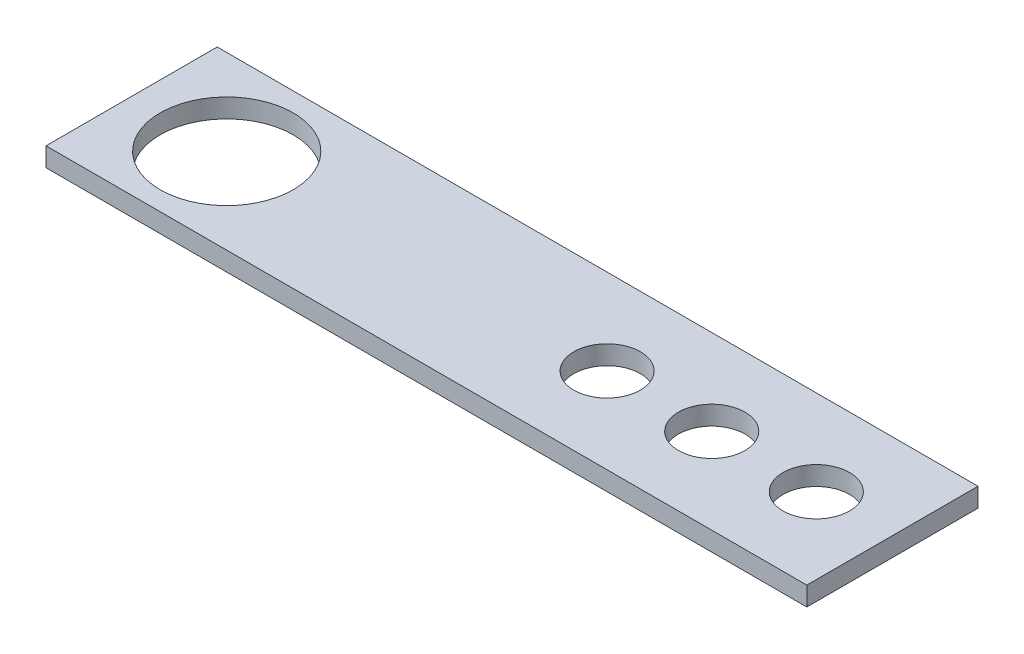
ISO-10303-21;
HEADER;
FILE_DESCRIPTION(('STEP AP214'),'2;1');
FILE_NAME('part.step','',(''),(''),'','','');
FILE_SCHEMA(('AUTOMOTIVE_DESIGN { 1 0 10303 214 1 1 1 1 }'));
ENDSEC;
DATA;
#1=APPLICATION_CONTEXT('core data for automotive mechanical design processes');
#2=APPLICATION_PROTOCOL_DEFINITION('international standard','automotive_design',2000,#1);
#3=PRODUCT_CONTEXT('',#1,'mechanical');
#4=PRODUCT('Part','Part','',(#3));
#5=PRODUCT_RELATED_PRODUCT_CATEGORY('part','',(#4));
#6=PRODUCT_DEFINITION_FORMATION('','',#4);
#7=PRODUCT_DEFINITION_CONTEXT('part definition',#1,'design');
#8=PRODUCT_DEFINITION('design','',#6,#7);
#9=PRODUCT_DEFINITION_SHAPE('','',#8);
#10=(LENGTH_UNIT() NAMED_UNIT(*) SI_UNIT(.MILLI.,.METRE.));
#11=(NAMED_UNIT(*) PLANE_ANGLE_UNIT() SI_UNIT($,.RADIAN.));
#12=(NAMED_UNIT(*) SI_UNIT($,.STERADIAN.) SOLID_ANGLE_UNIT());
#13=UNCERTAINTY_MEASURE_WITH_UNIT(LENGTH_MEASURE(1.E-05),#10,'distance_accuracy_value','');
#14=(GEOMETRIC_REPRESENTATION_CONTEXT(3) GLOBAL_UNCERTAINTY_ASSIGNED_CONTEXT((#13)) GLOBAL_UNIT_ASSIGNED_CONTEXT((#10,
#11,#12)) REPRESENTATION_CONTEXT('',''));
#15=CARTESIAN_POINT('',(0.,0.,0.));
#16=DIRECTION('',(0.,0.,1.));
#17=DIRECTION('',(1.,0.,0.));
#18=AXIS2_PLACEMENT_3D('',#15,#16,#17);
#19=CARTESIAN_POINT('',(16.,-2.,0.));
#20=DIRECTION('',(0.,1.,0.));
#21=DIRECTION('',(0.,0.,1.));
#22=AXIS2_PLACEMENT_3D('',#19,#20,#21);
#23=CYLINDRICAL_SURFACE('',#22,1.75);
#24=CARTESIAN_POINT('',(16.,0.,0.));
#25=DIRECTION('',(0.,-1.,0.));
#26=DIRECTION('',(0.,0.,-1.));
#27=AXIS2_PLACEMENT_3D('',#24,#25,#26);
#28=CIRCLE('',#27,1.75);
#29=CARTESIAN_POINT('',(16.,0.,-1.75));
#30=VERTEX_POINT('',#29);
#31=EDGE_CURVE('E40',#30,#30,#28,.T.);
#32=ORIENTED_EDGE('',*,*,#31,.T.);
#33=EDGE_LOOP('',(#32));
#34=FACE_BOUND('',#33,.T.);
#35=CARTESIAN_POINT('',(16.,1.,0.));
#36=DIRECTION('',(0.,1.,0.));
#37=DIRECTION('',(0.,0.,1.));
#38=AXIS2_PLACEMENT_3D('',#35,#36,#37);
#39=CIRCLE('',#38,1.75);
#40=CARTESIAN_POINT('',(16.,1.,1.75));
#41=VERTEX_POINT('',#40);
#42=EDGE_CURVE('E11',#41,#41,#39,.T.);
#43=ORIENTED_EDGE('',*,*,#42,.T.);
#44=EDGE_LOOP('',(#43));
#45=FACE_BOUND('',#44,.T.);
#46=ADVANCED_FACE('F32',(#34,#45),#23,.F.);
#47=CARTESIAN_POINT('',(20.,1.,4.5));
#48=DIRECTION('',(-1.,0.,0.));
#49=DIRECTION('',(0.,0.,1.));
#50=AXIS2_PLACEMENT_3D('',#47,#48,#49);
#51=PLANE('',#50);
#52=DIRECTION('',(0.,0.,-1.));
#53=VECTOR('',#52,1.);
#54=CARTESIAN_POINT('',(20.,0.,4.5));
#55=LINE('',#54,#53);
#56=CARTESIAN_POINT('',(20.,0.,4.5));
#57=VERTEX_POINT('',#56);
#58=CARTESIAN_POINT('',(20.,0.,-4.5));
#59=VERTEX_POINT('',#58);
#60=EDGE_CURVE('E100',#57,#59,#55,.T.);
#61=ORIENTED_EDGE('',*,*,#60,.T.);
#62=DIRECTION('',(0.,-1.,0.));
#63=VECTOR('',#62,1.);
#64=CARTESIAN_POINT('',(20.,1.,-4.5));
#65=LINE('',#64,#63);
#66=CARTESIAN_POINT('',(20.,1.,-4.5));
#67=VERTEX_POINT('',#66);
#68=EDGE_CURVE('E91',#67,#59,#65,.T.);
#69=ORIENTED_EDGE('',*,*,#68,.F.);
#70=DIRECTION('',(0.,0.,-1.));
#71=VECTOR('',#70,1.);
#72=CARTESIAN_POINT('',(20.,1.,4.5));
#73=LINE('',#72,#71);
#74=CARTESIAN_POINT('',(20.,1.,4.5));
#75=VERTEX_POINT('',#74);
#76=EDGE_CURVE('E85',#75,#67,#73,.T.);
#77=ORIENTED_EDGE('',*,*,#76,.F.);
#78=DIRECTION('',(0.,-1.,0.));
#79=VECTOR('',#78,1.);
#80=CARTESIAN_POINT('',(20.,1.,4.5));
#81=LINE('',#80,#79);
#82=EDGE_CURVE('E96',#75,#57,#81,.T.);
#83=ORIENTED_EDGE('',*,*,#82,.T.);
#84=EDGE_LOOP('',(#61,#69,#77,#83));
#85=FACE_BOUND('',#84,.T.);
#86=ADVANCED_FACE('F140',(#85),#51,.F.);
#87=CARTESIAN_POINT('',(-20.,1.,-4.5));
#88=DIRECTION('',(0.,0.,1.));
#89=DIRECTION('',(1.,0.,0.));
#90=AXIS2_PLACEMENT_3D('',#87,#88,#89);
#91=PLANE('',#90);
#92=DIRECTION('',(-1.,0.,0.));
#93=VECTOR('',#92,1.);
#94=CARTESIAN_POINT('',(-20.,0.,-4.5));
#95=LINE('',#94,#93);
#96=CARTESIAN_POINT('',(-20.,0.,-4.5));
#97=VERTEX_POINT('',#96);
#98=EDGE_CURVE('E90',#59,#97,#95,.T.);
#99=ORIENTED_EDGE('',*,*,#98,.T.);
#100=DIRECTION('',(0.,-1.,0.));
#101=VECTOR('',#100,1.);
#102=CARTESIAN_POINT('',(-20.,1.,-4.5));
#103=LINE('',#102,#101);
#104=CARTESIAN_POINT('',(-20.,1.,-4.5));
#105=VERTEX_POINT('',#104);
#106=EDGE_CURVE('E88',#105,#97,#103,.T.);
#107=ORIENTED_EDGE('',*,*,#106,.F.);
#108=DIRECTION('',(-1.,0.,0.));
#109=VECTOR('',#108,1.);
#110=CARTESIAN_POINT('',(-20.,1.,-4.5));
#111=LINE('',#110,#109);
#112=EDGE_CURVE('E79',#67,#105,#111,.T.);
#113=ORIENTED_EDGE('',*,*,#112,.F.);
#114=ORIENTED_EDGE('',*,*,#68,.T.);
#115=EDGE_LOOP('',(#99,#107,#113,#114));
#116=FACE_BOUND('',#115,.T.);
#117=ADVANCED_FACE('F89',(#116),#91,.F.);
#118=CARTESIAN_POINT('',(-20.,1.,4.5));
#119=DIRECTION('',(1.,0.,0.));
#120=DIRECTION('',(0.,0.,-1.));
#121=AXIS2_PLACEMENT_3D('',#118,#119,#120);
#122=PLANE('',#121);
#123=DIRECTION('',(0.,0.,1.));
#124=VECTOR('',#123,1.);
#125=CARTESIAN_POINT('',(-20.,0.,4.5));
#126=LINE('',#125,#124);
#127=CARTESIAN_POINT('',(-20.,0.,4.5));
#128=VERTEX_POINT('',#127);
#129=EDGE_CURVE('E65',#97,#128,#126,.T.);
#130=ORIENTED_EDGE('',*,*,#129,.T.);
#131=DIRECTION('',(0.,-1.,0.));
#132=VECTOR('',#131,1.);
#133=CARTESIAN_POINT('',(-20.,1.,4.5));
#134=LINE('',#133,#132);
#135=CARTESIAN_POINT('',(-20.,1.,4.5));
#136=VERTEX_POINT('',#135);
#137=EDGE_CURVE('E92',#136,#128,#134,.T.);
#138=ORIENTED_EDGE('',*,*,#137,.F.);
#139=DIRECTION('',(0.,0.,1.));
#140=VECTOR('',#139,1.);
#141=CARTESIAN_POINT('',(-20.,1.,4.5));
#142=LINE('',#141,#140);
#143=EDGE_CURVE('E83',#105,#136,#142,.T.);
#144=ORIENTED_EDGE('',*,*,#143,.F.);
#145=ORIENTED_EDGE('',*,*,#106,.T.);
#146=EDGE_LOOP('',(#130,#138,#144,#145));
#147=FACE_BOUND('',#146,.T.);
#148=ADVANCED_FACE('F94',(#147),#122,.F.);
#149=CARTESIAN_POINT('',(-20.,1.,4.5));
#150=DIRECTION('',(0.,0.,-1.));
#151=DIRECTION('',(-1.,0.,0.));
#152=AXIS2_PLACEMENT_3D('',#149,#150,#151);
#153=PLANE('',#152);
#154=DIRECTION('',(1.,0.,0.));
#155=VECTOR('',#154,1.);
#156=CARTESIAN_POINT('',(-20.,0.,4.5));
#157=LINE('',#156,#155);
#158=EDGE_CURVE('E71',#128,#57,#157,.T.);
#159=ORIENTED_EDGE('',*,*,#158,.T.);
#160=ORIENTED_EDGE('',*,*,#82,.F.);
#161=DIRECTION('',(1.,0.,0.));
#162=VECTOR('',#161,1.);
#163=CARTESIAN_POINT('',(-20.,1.,4.5));
#164=LINE('',#163,#162);
#165=EDGE_CURVE('E48',#136,#75,#164,.T.);
#166=ORIENTED_EDGE('',*,*,#165,.F.);
#167=ORIENTED_EDGE('',*,*,#137,.T.);
#168=EDGE_LOOP('',(#159,#160,#166,#167));
#169=FACE_BOUND('',#168,.T.);
#170=ADVANCED_FACE('F133',(#169),#153,.F.);
#171=CARTESIAN_POINT('',(0.,1.,0.));
#172=DIRECTION('',(0.,-1.,0.));
#173=DIRECTION('',(0.,0.,-1.));
#174=AXIS2_PLACEMENT_3D('',#171,#172,#173);
#175=PLANE('',#174);
#176=CARTESIAN_POINT('',(10.5,1.,0.));
#177=DIRECTION('',(0.,1.,0.));
#178=DIRECTION('',(0.,0.,1.));
#179=AXIS2_PLACEMENT_3D('',#176,#177,#178);
#180=CIRCLE('',#179,1.75);
#181=CARTESIAN_POINT('',(10.5,1.,1.75));
#182=VERTEX_POINT('',#181);
#183=EDGE_CURVE('E202',#182,#182,#180,.T.);
#184=ORIENTED_EDGE('',*,*,#183,.F.);
#185=EDGE_LOOP('',(#184));
#186=FACE_BOUND('',#185,.T.);
#187=CARTESIAN_POINT('',(5.,1.,0.));
#188=DIRECTION('',(0.,1.,0.));
#189=DIRECTION('',(0.,0.,1.));
#190=AXIS2_PLACEMENT_3D('',#187,#188,#189);
#191=CIRCLE('',#190,1.75);
#192=CARTESIAN_POINT('',(5.,1.,1.75));
#193=VERTEX_POINT('',#192);
#194=EDGE_CURVE('E115',#193,#193,#191,.T.);
#195=ORIENTED_EDGE('',*,*,#194,.F.);
#196=EDGE_LOOP('',(#195));
#197=FACE_BOUND('',#196,.T.);
#198=CARTESIAN_POINT('',(-15.,1.,0.));
#199=DIRECTION('',(0.,1.,0.));
#200=DIRECTION('',(0.,0.,1.));
#201=AXIS2_PLACEMENT_3D('',#198,#199,#200);
#202=CIRCLE('',#201,3.5);
#203=CARTESIAN_POINT('',(-15.,1.,3.5));
#204=VERTEX_POINT('',#203);
#205=EDGE_CURVE('E112',#204,#204,#202,.T.);
#206=ORIENTED_EDGE('',*,*,#205,.F.);
#207=EDGE_LOOP('',(#206));
#208=FACE_BOUND('',#207,.T.);
#209=ORIENTED_EDGE('',*,*,#76,.T.);
#210=ORIENTED_EDGE('',*,*,#112,.T.);
#211=ORIENTED_EDGE('',*,*,#143,.T.);
#212=ORIENTED_EDGE('',*,*,#165,.T.);
#213=EDGE_LOOP('',(#209,#210,#211,#212));
#214=FACE_BOUND('',#213,.T.);
#215=ORIENTED_EDGE('',*,*,#42,.F.);
#216=EDGE_LOOP('',(#215));
#217=FACE_BOUND('',#216,.T.);
#218=ADVANCED_FACE('F80',(#186,#197,#208,#214,#217),#175,.F.);
#219=CARTESIAN_POINT('',(0.,0.,0.));
#220=DIRECTION('',(0.,-1.,0.));
#221=DIRECTION('',(0.,0.,-1.));
#222=AXIS2_PLACEMENT_3D('',#219,#220,#221);
#223=PLANE('',#222);
#224=CARTESIAN_POINT('',(10.5,0.,0.));
#225=DIRECTION('',(0.,-1.,0.));
#226=DIRECTION('',(0.,0.,-1.));
#227=AXIS2_PLACEMENT_3D('',#224,#225,#226);
#228=CIRCLE('',#227,1.75);
#229=CARTESIAN_POINT('',(10.5,0.,-1.75));
#230=VERTEX_POINT('',#229);
#231=EDGE_CURVE('E205',#230,#230,#228,.T.);
#232=ORIENTED_EDGE('',*,*,#231,.F.);
#233=EDGE_LOOP('',(#232));
#234=FACE_BOUND('',#233,.T.);
#235=CARTESIAN_POINT('',(5.,0.,0.));
#236=DIRECTION('',(0.,-1.,0.));
#237=DIRECTION('',(0.,0.,-1.));
#238=AXIS2_PLACEMENT_3D('',#235,#236,#237);
#239=CIRCLE('',#238,1.75);
#240=CARTESIAN_POINT('',(5.,0.,-1.75));
#241=VERTEX_POINT('',#240);
#242=EDGE_CURVE('E113',#241,#241,#239,.T.);
#243=ORIENTED_EDGE('',*,*,#242,.F.);
#244=EDGE_LOOP('',(#243));
#245=FACE_BOUND('',#244,.T.);
#246=CARTESIAN_POINT('',(-15.,0.,0.));
#247=DIRECTION('',(0.,-1.,0.));
#248=DIRECTION('',(0.,0.,-1.));
#249=AXIS2_PLACEMENT_3D('',#246,#247,#248);
#250=CIRCLE('',#249,3.5);
#251=CARTESIAN_POINT('',(-15.,0.,-3.5));
#252=VERTEX_POINT('',#251);
#253=EDGE_CURVE('E103',#252,#252,#250,.T.);
#254=ORIENTED_EDGE('',*,*,#253,.F.);
#255=EDGE_LOOP('',(#254));
#256=FACE_BOUND('',#255,.T.);
#257=ORIENTED_EDGE('',*,*,#60,.F.);
#258=ORIENTED_EDGE('',*,*,#158,.F.);
#259=ORIENTED_EDGE('',*,*,#129,.F.);
#260=ORIENTED_EDGE('',*,*,#98,.F.);
#261=EDGE_LOOP('',(#257,#258,#259,#260));
#262=FACE_BOUND('',#261,.T.);
#263=ORIENTED_EDGE('',*,*,#31,.F.);
#264=EDGE_LOOP('',(#263));
#265=FACE_BOUND('',#264,.T.);
#266=ADVANCED_FACE('F121',(#234,#245,#256,#262,#265),#223,.T.);
#267=CARTESIAN_POINT('',(-15.,-2.,0.));
#268=DIRECTION('',(0.,1.,0.));
#269=DIRECTION('',(0.,0.,1.));
#270=AXIS2_PLACEMENT_3D('',#267,#268,#269);
#271=CYLINDRICAL_SURFACE('',#270,3.5);
#272=ORIENTED_EDGE('',*,*,#253,.T.);
#273=EDGE_LOOP('',(#272));
#274=FACE_BOUND('',#273,.T.);
#275=ORIENTED_EDGE('',*,*,#205,.T.);
#276=EDGE_LOOP('',(#275));
#277=FACE_BOUND('',#276,.T.);
#278=ADVANCED_FACE('F123',(#274,#277),#271,.F.);
#279=CARTESIAN_POINT('',(5.,-2.,0.));
#280=DIRECTION('',(0.,1.,0.));
#281=DIRECTION('',(0.,0.,1.));
#282=AXIS2_PLACEMENT_3D('',#279,#280,#281);
#283=CYLINDRICAL_SURFACE('',#282,1.75);
#284=ORIENTED_EDGE('',*,*,#242,.T.);
#285=EDGE_LOOP('',(#284));
#286=FACE_BOUND('',#285,.T.);
#287=ORIENTED_EDGE('',*,*,#194,.T.);
#288=EDGE_LOOP('',(#287));
#289=FACE_BOUND('',#288,.T.);
#290=ADVANCED_FACE('F130',(#286,#289),#283,.F.);
#291=CARTESIAN_POINT('',(10.5,-2.,0.));
#292=DIRECTION('',(0.,1.,0.));
#293=DIRECTION('',(0.,0.,1.));
#294=AXIS2_PLACEMENT_3D('',#291,#292,#293);
#295=CYLINDRICAL_SURFACE('',#294,1.75);
#296=ORIENTED_EDGE('',*,*,#231,.T.);
#297=EDGE_LOOP('',(#296));
#298=FACE_BOUND('',#297,.T.);
#299=ORIENTED_EDGE('',*,*,#183,.T.);
#300=EDGE_LOOP('',(#299));
#301=FACE_BOUND('',#300,.T.);
#302=ADVANCED_FACE('F174',(#298,#301),#295,.F.);
#303=CLOSED_SHELL('',(#46,#86,#117,#148,#170,#218,#266,#278,#290,#302));
#304=MANIFOLD_SOLID_BREP('B2',#303);
#305=ADVANCED_BREP_SHAPE_REPRESENTATION('',(#18,#304),#14);
#306=SHAPE_DEFINITION_REPRESENTATION(#9,#305);
ENDSEC;
END-ISO-10303-21;
